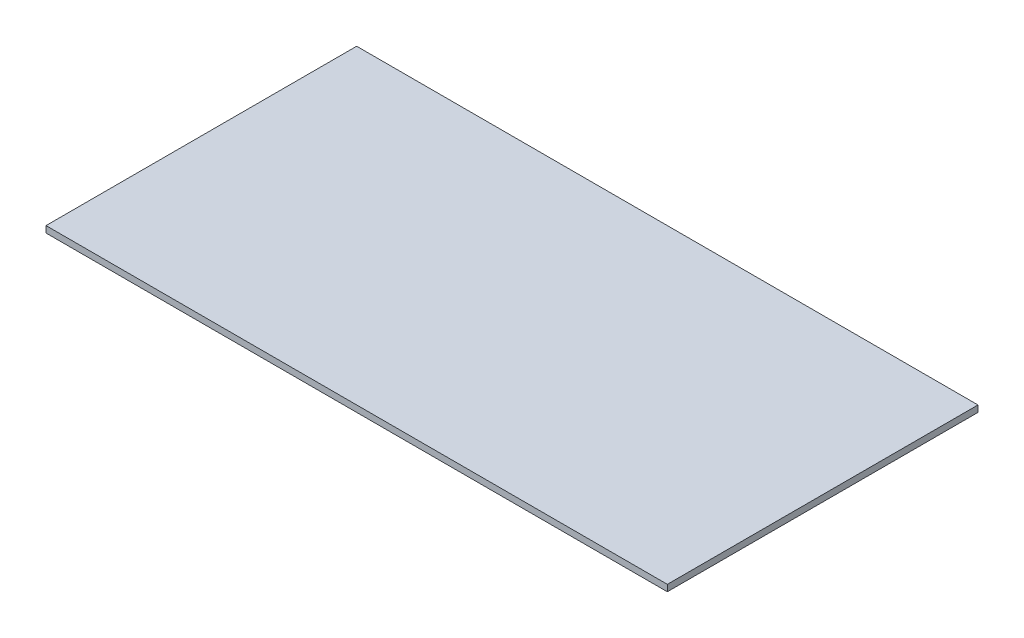
ISO-10303-21;
HEADER;
FILE_DESCRIPTION(('STEP AP214'),'2;1');
FILE_NAME('part.step','',(''),(''),'','','');
FILE_SCHEMA(('AUTOMOTIVE_DESIGN { 1 0 10303 214 1 1 1 1 }'));
ENDSEC;
DATA;
#1=APPLICATION_CONTEXT('core data for automotive mechanical design processes');
#2=APPLICATION_PROTOCOL_DEFINITION('international standard','automotive_design',2000,#1);
#3=PRODUCT_CONTEXT('',#1,'mechanical');
#4=PRODUCT('Part','Part','',(#3));
#5=PRODUCT_RELATED_PRODUCT_CATEGORY('part','',(#4));
#6=PRODUCT_DEFINITION_FORMATION('','',#4);
#7=PRODUCT_DEFINITION_CONTEXT('part definition',#1,'design');
#8=PRODUCT_DEFINITION('design','',#6,#7);
#9=PRODUCT_DEFINITION_SHAPE('','',#8);
#10=(LENGTH_UNIT() NAMED_UNIT(*) SI_UNIT(.MILLI.,.METRE.));
#11=(NAMED_UNIT(*) PLANE_ANGLE_UNIT() SI_UNIT($,.RADIAN.));
#12=(NAMED_UNIT(*) SI_UNIT($,.STERADIAN.) SOLID_ANGLE_UNIT());
#13=UNCERTAINTY_MEASURE_WITH_UNIT(LENGTH_MEASURE(1.E-05),#10,'distance_accuracy_value','');
#14=(GEOMETRIC_REPRESENTATION_CONTEXT(3) GLOBAL_UNCERTAINTY_ASSIGNED_CONTEXT((#13)) GLOBAL_UNIT_ASSIGNED_CONTEXT((#10,
#11,#12)) REPRESENTATION_CONTEXT('',''));
#15=CARTESIAN_POINT('',(0.,0.,0.));
#16=DIRECTION('',(0.,0.,1.));
#17=DIRECTION('',(1.,0.,0.));
#18=AXIS2_PLACEMENT_3D('',#15,#16,#17);
#19=CARTESIAN_POINT('',(304.8,3.175,152.4));
#20=DIRECTION('',(-1.,0.,0.));
#21=DIRECTION('',(0.,0.,1.));
#22=AXIS2_PLACEMENT_3D('',#19,#20,#21);
#23=PLANE('',#22);
#24=DIRECTION('',(0.,0.,-1.));
#25=VECTOR('',#24,1.);
#26=CARTESIAN_POINT('',(304.8,-3.175,152.4));
#27=LINE('',#26,#25);
#28=CARTESIAN_POINT('',(304.8,-3.175,152.4));
#29=VERTEX_POINT('',#28);
#30=CARTESIAN_POINT('',(304.8,-3.175,-152.4));
#31=VERTEX_POINT('',#30);
#32=EDGE_CURVE('E96',#29,#31,#27,.T.);
#33=ORIENTED_EDGE('',*,*,#32,.T.);
#34=DIRECTION('',(0.,-1.,0.));
#35=VECTOR('',#34,1.);
#36=CARTESIAN_POINT('',(304.8,3.175,-152.4));
#37=LINE('',#36,#35);
#38=CARTESIAN_POINT('',(304.8,3.175,-152.4));
#39=VERTEX_POINT('',#38);
#40=EDGE_CURVE('E11',#39,#31,#37,.T.);
#41=ORIENTED_EDGE('',*,*,#40,.F.);
#42=DIRECTION('',(0.,0.,-1.));
#43=VECTOR('',#42,1.);
#44=CARTESIAN_POINT('',(304.8,3.175,152.4));
#45=LINE('',#44,#43);
#46=CARTESIAN_POINT('',(304.8,3.175,152.4));
#47=VERTEX_POINT('',#46);
#48=EDGE_CURVE('E84',#47,#39,#45,.T.);
#49=ORIENTED_EDGE('',*,*,#48,.F.);
#50=DIRECTION('',(0.,-1.,0.));
#51=VECTOR('',#50,1.);
#52=CARTESIAN_POINT('',(304.8,3.175,152.4));
#53=LINE('',#52,#51);
#54=EDGE_CURVE('E92',#47,#29,#53,.T.);
#55=ORIENTED_EDGE('',*,*,#54,.T.);
#56=EDGE_LOOP('',(#33,#41,#49,#55));
#57=FACE_BOUND('',#56,.T.);
#58=ADVANCED_FACE('F33',(#57),#23,.F.);
#59=CARTESIAN_POINT('',(-304.8,3.175,-152.4));
#60=DIRECTION('',(0.,0.,1.));
#61=DIRECTION('',(1.,0.,0.));
#62=AXIS2_PLACEMENT_3D('',#59,#60,#61);
#63=PLANE('',#62);
#64=DIRECTION('',(-1.,0.,0.));
#65=VECTOR('',#64,1.);
#66=CARTESIAN_POINT('',(-304.8,-3.175,-152.4));
#67=LINE('',#66,#65);
#68=CARTESIAN_POINT('',(-304.8,-3.175,-152.4));
#69=VERTEX_POINT('',#68);
#70=EDGE_CURVE('E88',#31,#69,#67,.T.);
#71=ORIENTED_EDGE('',*,*,#70,.T.);
#72=DIRECTION('',(0.,-1.,0.));
#73=VECTOR('',#72,1.);
#74=CARTESIAN_POINT('',(-304.8,3.175,-152.4));
#75=LINE('',#74,#73);
#76=CARTESIAN_POINT('',(-304.8,3.175,-152.4));
#77=VERTEX_POINT('',#76);
#78=EDGE_CURVE('E41',#77,#69,#75,.T.);
#79=ORIENTED_EDGE('',*,*,#78,.F.);
#80=DIRECTION('',(-1.,0.,0.));
#81=VECTOR('',#80,1.);
#82=CARTESIAN_POINT('',(-304.8,3.175,-152.4));
#83=LINE('',#82,#81);
#84=EDGE_CURVE('E79',#39,#77,#83,.T.);
#85=ORIENTED_EDGE('',*,*,#84,.F.);
#86=ORIENTED_EDGE('',*,*,#40,.T.);
#87=EDGE_LOOP('',(#71,#79,#85,#86));
#88=FACE_BOUND('',#87,.T.);
#89=ADVANCED_FACE('F87',(#88),#63,.F.);
#90=CARTESIAN_POINT('',(-304.8,3.175,152.4));
#91=DIRECTION('',(1.,0.,0.));
#92=DIRECTION('',(0.,0.,-1.));
#93=AXIS2_PLACEMENT_3D('',#90,#91,#92);
#94=PLANE('',#93);
#95=DIRECTION('',(0.,0.,1.));
#96=VECTOR('',#95,1.);
#97=CARTESIAN_POINT('',(-304.8,-3.175,152.4));
#98=LINE('',#97,#96);
#99=CARTESIAN_POINT('',(-304.8,-3.175,152.4));
#100=VERTEX_POINT('',#99);
#101=EDGE_CURVE('E66',#69,#100,#98,.T.);
#102=ORIENTED_EDGE('',*,*,#101,.T.);
#103=DIRECTION('',(0.,-1.,0.));
#104=VECTOR('',#103,1.);
#105=CARTESIAN_POINT('',(-304.8,3.175,152.4));
#106=LINE('',#105,#104);
#107=CARTESIAN_POINT('',(-304.8,3.175,152.4));
#108=VERTEX_POINT('',#107);
#109=EDGE_CURVE('E89',#108,#100,#106,.T.);
#110=ORIENTED_EDGE('',*,*,#109,.F.);
#111=DIRECTION('',(0.,0.,1.));
#112=VECTOR('',#111,1.);
#113=CARTESIAN_POINT('',(-304.8,3.175,152.4));
#114=LINE('',#113,#112);
#115=EDGE_CURVE('E82',#77,#108,#114,.T.);
#116=ORIENTED_EDGE('',*,*,#115,.F.);
#117=ORIENTED_EDGE('',*,*,#78,.T.);
#118=EDGE_LOOP('',(#102,#110,#116,#117));
#119=FACE_BOUND('',#118,.T.);
#120=ADVANCED_FACE('F90',(#119),#94,.F.);
#121=CARTESIAN_POINT('',(-304.8,3.175,152.4));
#122=DIRECTION('',(0.,0.,-1.));
#123=DIRECTION('',(-1.,0.,0.));
#124=AXIS2_PLACEMENT_3D('',#121,#122,#123);
#125=PLANE('',#124);
#126=DIRECTION('',(1.,0.,0.));
#127=VECTOR('',#126,1.);
#128=CARTESIAN_POINT('',(-304.8,-3.175,152.4));
#129=LINE('',#128,#127);
#130=EDGE_CURVE('E72',#100,#29,#129,.T.);
#131=ORIENTED_EDGE('',*,*,#130,.T.);
#132=ORIENTED_EDGE('',*,*,#54,.F.);
#133=DIRECTION('',(1.,0.,0.));
#134=VECTOR('',#133,1.);
#135=CARTESIAN_POINT('',(-304.8,3.175,152.4));
#136=LINE('',#135,#134);
#137=EDGE_CURVE('E49',#108,#47,#136,.T.);
#138=ORIENTED_EDGE('',*,*,#137,.F.);
#139=ORIENTED_EDGE('',*,*,#109,.T.);
#140=EDGE_LOOP('',(#131,#132,#138,#139));
#141=FACE_BOUND('',#140,.T.);
#142=ADVANCED_FACE('F103',(#141),#125,.F.);
#143=CARTESIAN_POINT('',(0.,3.175,0.));
#144=DIRECTION('',(0.,-1.,0.));
#145=DIRECTION('',(0.,0.,-1.));
#146=AXIS2_PLACEMENT_3D('',#143,#144,#145);
#147=PLANE('',#146);
#148=ORIENTED_EDGE('',*,*,#48,.T.);
#149=ORIENTED_EDGE('',*,*,#84,.T.);
#150=ORIENTED_EDGE('',*,*,#115,.T.);
#151=ORIENTED_EDGE('',*,*,#137,.T.);
#152=EDGE_LOOP('',(#148,#149,#150,#151));
#153=FACE_BOUND('',#152,.T.);
#154=ADVANCED_FACE('F80',(#153),#147,.F.);
#155=CARTESIAN_POINT('',(0.,-3.175,0.));
#156=DIRECTION('',(0.,-1.,0.));
#157=DIRECTION('',(0.,0.,-1.));
#158=AXIS2_PLACEMENT_3D('',#155,#156,#157);
#159=PLANE('',#158);
#160=ORIENTED_EDGE('',*,*,#32,.F.);
#161=ORIENTED_EDGE('',*,*,#130,.F.);
#162=ORIENTED_EDGE('',*,*,#101,.F.);
#163=ORIENTED_EDGE('',*,*,#70,.F.);
#164=EDGE_LOOP('',(#160,#161,#162,#163));
#165=FACE_BOUND('',#164,.T.);
#166=ADVANCED_FACE('F106',(#165),#159,.T.);
#167=CLOSED_SHELL('',(#58,#89,#120,#142,#154,#166));
#168=MANIFOLD_SOLID_BREP('B2',#167);
#169=ADVANCED_BREP_SHAPE_REPRESENTATION('',(#18,#168),#14);
#170=SHAPE_DEFINITION_REPRESENTATION(#9,#169);
ENDSEC;
END-ISO-10303-21;
